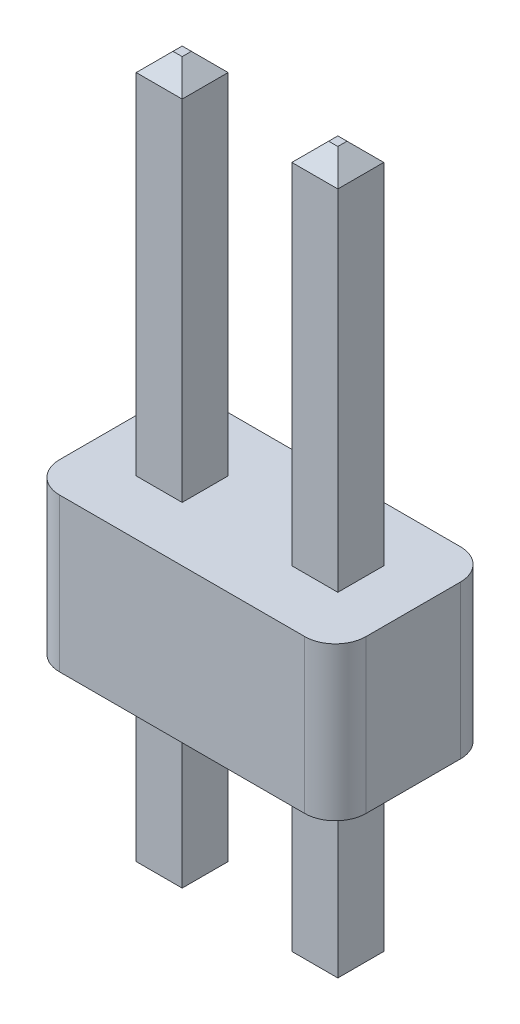
ISO-10303-21;
HEADER;
FILE_DESCRIPTION(('STEP AP214'),'2;1');
FILE_NAME('part.step','',(''),(''),'','','');
FILE_SCHEMA(('AUTOMOTIVE_DESIGN { 1 0 10303 214 1 1 1 1 }'));
ENDSEC;
DATA;
#1=APPLICATION_CONTEXT('core data for automotive mechanical design processes');
#2=APPLICATION_PROTOCOL_DEFINITION('international standard','automotive_design',2000,#1);
#3=PRODUCT_CONTEXT('',#1,'mechanical');
#4=PRODUCT('Part','Part','',(#3));
#5=PRODUCT_RELATED_PRODUCT_CATEGORY('part','',(#4));
#6=PRODUCT_DEFINITION_FORMATION('','',#4);
#7=PRODUCT_DEFINITION_CONTEXT('part definition',#1,'design');
#8=PRODUCT_DEFINITION('design','',#6,#7);
#9=PRODUCT_DEFINITION_SHAPE('','',#8);
#10=(LENGTH_UNIT() NAMED_UNIT(*) SI_UNIT(.MILLI.,.METRE.));
#11=(NAMED_UNIT(*) PLANE_ANGLE_UNIT() SI_UNIT($,.RADIAN.));
#12=(NAMED_UNIT(*) SI_UNIT($,.STERADIAN.) SOLID_ANGLE_UNIT());
#13=UNCERTAINTY_MEASURE_WITH_UNIT(LENGTH_MEASURE(1.E-05),#10,'distance_accuracy_value','');
#14=(GEOMETRIC_REPRESENTATION_CONTEXT(3) GLOBAL_UNCERTAINTY_ASSIGNED_CONTEXT((#13)) GLOBAL_UNIT_ASSIGNED_CONTEXT((#10,
#11,#12)) REPRESENTATION_CONTEXT('',''));
#15=CARTESIAN_POINT('',(0.,0.,0.));
#16=DIRECTION('',(0.,0.,1.));
#17=DIRECTION('',(1.,0.,0.));
#18=AXIS2_PLACEMENT_3D('',#15,#16,#17);
#19=CARTESIAN_POINT('',(2.,2.5,0.77));
#20=DIRECTION('',(0.,-1.,0.));
#21=DIRECTION('',(0.,0.,-1.));
#22=AXIS2_PLACEMENT_3D('',#19,#20,#21);
#23=CYLINDRICAL_SURFACE('',#22,0.5);
#24=CARTESIAN_POINT('',(2.,0.,0.77));
#25=DIRECTION('',(0.,1.,0.));
#26=DIRECTION('',(0.,0.,1.));
#27=AXIS2_PLACEMENT_3D('',#24,#25,#26);
#28=CIRCLE('',#27,0.5);
#29=CARTESIAN_POINT('',(2.,0.,1.27));
#30=VERTEX_POINT('',#29);
#31=CARTESIAN_POINT('',(2.5,0.,0.77));
#32=VERTEX_POINT('',#31);
#33=EDGE_CURVE('E300',#30,#32,#28,.T.);
#34=ORIENTED_EDGE('',*,*,#33,.T.);
#35=DIRECTION('',(0.,-1.,0.));
#36=VECTOR('',#35,1.);
#37=CARTESIAN_POINT('',(2.5,2.5,0.77));
#38=LINE('',#37,#36);
#39=CARTESIAN_POINT('',(2.5,2.5,0.77));
#40=VERTEX_POINT('',#39);
#41=EDGE_CURVE('E355',#40,#32,#38,.T.);
#42=ORIENTED_EDGE('',*,*,#41,.F.);
#43=CARTESIAN_POINT('',(2.,2.5,0.77));
#44=DIRECTION('',(0.,1.,0.));
#45=DIRECTION('',(0.,0.,1.));
#46=AXIS2_PLACEMENT_3D('',#43,#44,#45);
#47=CIRCLE('',#46,0.5);
#48=CARTESIAN_POINT('',(2.,2.5,1.27));
#49=VERTEX_POINT('',#48);
#50=EDGE_CURVE('E301',#49,#40,#47,.T.);
#51=ORIENTED_EDGE('',*,*,#50,.F.);
#52=DIRECTION('',(0.,-1.,0.));
#53=VECTOR('',#52,1.);
#54=CARTESIAN_POINT('',(2.,2.5,1.27));
#55=LINE('',#54,#53);
#56=EDGE_CURVE('E319',#49,#30,#55,.T.);
#57=ORIENTED_EDGE('',*,*,#56,.T.);
#58=EDGE_LOOP('',(#34,#42,#51,#57));
#59=FACE_BOUND('',#58,.T.);
#60=ADVANCED_FACE('F34',(#59),#23,.T.);
#61=CARTESIAN_POINT('',(2.5,2.5,-0.77));
#62=DIRECTION('',(-1.,0.,0.));
#63=DIRECTION('',(0.,0.,1.));
#64=AXIS2_PLACEMENT_3D('',#61,#62,#63);
#65=PLANE('',#64);
#66=DIRECTION('',(0.,0.,-1.));
#67=VECTOR('',#66,1.);
#68=CARTESIAN_POINT('',(2.5,0.,-0.77));
#69=LINE('',#68,#67);
#70=CARTESIAN_POINT('',(2.5,0.,-0.77));
#71=VERTEX_POINT('',#70);
#72=EDGE_CURVE('E322',#32,#71,#69,.T.);
#73=ORIENTED_EDGE('',*,*,#72,.T.);
#74=DIRECTION('',(0.,-1.,0.));
#75=VECTOR('',#74,1.);
#76=CARTESIAN_POINT('',(2.5,2.5,-0.77));
#77=LINE('',#76,#75);
#78=CARTESIAN_POINT('',(2.5,2.5,-0.77));
#79=VERTEX_POINT('',#78);
#80=EDGE_CURVE('E352',#79,#71,#77,.T.);
#81=ORIENTED_EDGE('',*,*,#80,.F.);
#82=DIRECTION('',(0.,0.,-1.));
#83=VECTOR('',#82,1.);
#84=CARTESIAN_POINT('',(2.5,2.5,-0.77));
#85=LINE('',#84,#83);
#86=EDGE_CURVE('E304',#40,#79,#85,.T.);
#87=ORIENTED_EDGE('',*,*,#86,.F.);
#88=ORIENTED_EDGE('',*,*,#41,.T.);
#89=EDGE_LOOP('',(#73,#81,#87,#88));
#90=FACE_BOUND('',#89,.T.);
#91=ADVANCED_FACE('F521',(#90),#65,.F.);
#92=CARTESIAN_POINT('',(2.,2.5,-0.77));
#93=DIRECTION('',(0.,-1.,0.));
#94=DIRECTION('',(0.,0.,-1.));
#95=AXIS2_PLACEMENT_3D('',#92,#93,#94);
#96=CYLINDRICAL_SURFACE('',#95,0.5);
#97=CARTESIAN_POINT('',(2.,0.,-0.77));
#98=DIRECTION('',(0.,1.,0.));
#99=DIRECTION('',(0.,0.,1.));
#100=AXIS2_PLACEMENT_3D('',#97,#98,#99);
#101=CIRCLE('',#100,0.5);
#102=CARTESIAN_POINT('',(2.,0.,-1.27));
#103=VERTEX_POINT('',#102);
#104=EDGE_CURVE('E324',#71,#103,#101,.T.);
#105=ORIENTED_EDGE('',*,*,#104,.T.);
#106=DIRECTION('',(0.,-1.,0.));
#107=VECTOR('',#106,1.);
#108=CARTESIAN_POINT('',(2.,2.5,-1.27));
#109=LINE('',#108,#107);
#110=CARTESIAN_POINT('',(2.,2.5,-1.27));
#111=VERTEX_POINT('',#110);
#112=EDGE_CURVE('E349',#111,#103,#109,.T.);
#113=ORIENTED_EDGE('',*,*,#112,.F.);
#114=CARTESIAN_POINT('',(2.,2.5,-0.77));
#115=DIRECTION('',(0.,1.,0.));
#116=DIRECTION('',(0.,0.,1.));
#117=AXIS2_PLACEMENT_3D('',#114,#115,#116);
#118=CIRCLE('',#117,0.5);
#119=EDGE_CURVE('E307',#79,#111,#118,.T.);
#120=ORIENTED_EDGE('',*,*,#119,.F.);
#121=ORIENTED_EDGE('',*,*,#80,.T.);
#122=EDGE_LOOP('',(#105,#113,#120,#121));
#123=FACE_BOUND('',#122,.T.);
#124=ADVANCED_FACE('F527',(#123),#96,.T.);
#125=CARTESIAN_POINT('',(-2.,2.5,-1.27));
#126=DIRECTION('',(0.,0.,1.));
#127=DIRECTION('',(1.,0.,0.));
#128=AXIS2_PLACEMENT_3D('',#125,#126,#127);
#129=PLANE('',#128);
#130=DIRECTION('',(-1.,0.,0.));
#131=VECTOR('',#130,1.);
#132=CARTESIAN_POINT('',(-2.,0.,-1.27));
#133=LINE('',#132,#131);
#134=CARTESIAN_POINT('',(-2.,0.,-1.27));
#135=VERTEX_POINT('',#134);
#136=EDGE_CURVE('E326',#103,#135,#133,.T.);
#137=ORIENTED_EDGE('',*,*,#136,.T.);
#138=DIRECTION('',(0.,-1.,0.));
#139=VECTOR('',#138,1.);
#140=CARTESIAN_POINT('',(-2.,2.5,-1.27));
#141=LINE('',#140,#139);
#142=CARTESIAN_POINT('',(-2.,2.5,-1.27));
#143=VERTEX_POINT('',#142);
#144=EDGE_CURVE('E346',#143,#135,#141,.T.);
#145=ORIENTED_EDGE('',*,*,#144,.F.);
#146=DIRECTION('',(-1.,0.,0.));
#147=VECTOR('',#146,1.);
#148=CARTESIAN_POINT('',(-2.,2.5,-1.27));
#149=LINE('',#148,#147);
#150=EDGE_CURVE('E309',#111,#143,#149,.T.);
#151=ORIENTED_EDGE('',*,*,#150,.F.);
#152=ORIENTED_EDGE('',*,*,#112,.T.);
#153=EDGE_LOOP('',(#137,#145,#151,#152));
#154=FACE_BOUND('',#153,.T.);
#155=ADVANCED_FACE('F871',(#154),#129,.F.);
#156=CARTESIAN_POINT('',(-2.,2.5,-0.77));
#157=DIRECTION('',(0.,-1.,0.));
#158=DIRECTION('',(0.,0.,-1.));
#159=AXIS2_PLACEMENT_3D('',#156,#157,#158);
#160=CYLINDRICAL_SURFACE('',#159,0.5);
#161=CARTESIAN_POINT('',(-2.,0.,-0.77));
#162=DIRECTION('',(0.,1.,0.));
#163=DIRECTION('',(0.,0.,1.));
#164=AXIS2_PLACEMENT_3D('',#161,#162,#163);
#165=CIRCLE('',#164,0.5);
#166=CARTESIAN_POINT('',(-2.5,0.,-0.77));
#167=VERTEX_POINT('',#166);
#168=EDGE_CURVE('E328',#135,#167,#165,.T.);
#169=ORIENTED_EDGE('',*,*,#168,.T.);
#170=DIRECTION('',(0.,-1.,0.));
#171=VECTOR('',#170,1.);
#172=CARTESIAN_POINT('',(-2.5,2.5,-0.77));
#173=LINE('',#172,#171);
#174=CARTESIAN_POINT('',(-2.5,2.5,-0.77));
#175=VERTEX_POINT('',#174);
#176=EDGE_CURVE('E343',#175,#167,#173,.T.);
#177=ORIENTED_EDGE('',*,*,#176,.F.);
#178=CARTESIAN_POINT('',(-2.,2.5,-0.77));
#179=DIRECTION('',(0.,1.,0.));
#180=DIRECTION('',(0.,0.,1.));
#181=AXIS2_PLACEMENT_3D('',#178,#179,#180);
#182=CIRCLE('',#181,0.5);
#183=EDGE_CURVE('E311',#143,#175,#182,.T.);
#184=ORIENTED_EDGE('',*,*,#183,.F.);
#185=ORIENTED_EDGE('',*,*,#144,.T.);
#186=EDGE_LOOP('',(#169,#177,#184,#185));
#187=FACE_BOUND('',#186,.T.);
#188=ADVANCED_FACE('F860',(#187),#160,.T.);
#189=CARTESIAN_POINT('',(-2.5,2.5,0.77));
#190=DIRECTION('',(1.,0.,0.));
#191=DIRECTION('',(0.,0.,-1.));
#192=AXIS2_PLACEMENT_3D('',#189,#190,#191);
#193=PLANE('',#192);
#194=DIRECTION('',(0.,0.,1.));
#195=VECTOR('',#194,1.);
#196=CARTESIAN_POINT('',(-2.5,0.,0.77));
#197=LINE('',#196,#195);
#198=CARTESIAN_POINT('',(-2.5,0.,0.77));
#199=VERTEX_POINT('',#198);
#200=EDGE_CURVE('E330',#167,#199,#197,.T.);
#201=ORIENTED_EDGE('',*,*,#200,.T.);
#202=DIRECTION('',(0.,-1.,0.));
#203=VECTOR('',#202,1.);
#204=CARTESIAN_POINT('',(-2.5,2.5,0.77));
#205=LINE('',#204,#203);
#206=CARTESIAN_POINT('',(-2.5,2.5,0.77));
#207=VERTEX_POINT('',#206);
#208=EDGE_CURVE('E340',#207,#199,#205,.T.);
#209=ORIENTED_EDGE('',*,*,#208,.F.);
#210=DIRECTION('',(0.,0.,1.));
#211=VECTOR('',#210,1.);
#212=CARTESIAN_POINT('',(-2.5,2.5,0.77));
#213=LINE('',#212,#211);
#214=EDGE_CURVE('E313',#175,#207,#213,.T.);
#215=ORIENTED_EDGE('',*,*,#214,.F.);
#216=ORIENTED_EDGE('',*,*,#176,.T.);
#217=EDGE_LOOP('',(#201,#209,#215,#216));
#218=FACE_BOUND('',#217,.T.);
#219=ADVANCED_FACE('F849',(#218),#193,.F.);
#220=CARTESIAN_POINT('',(-2.,2.5,0.77));
#221=DIRECTION('',(0.,-1.,0.));
#222=DIRECTION('',(0.,0.,-1.));
#223=AXIS2_PLACEMENT_3D('',#220,#221,#222);
#224=CYLINDRICAL_SURFACE('',#223,0.5);
#225=CARTESIAN_POINT('',(-2.,0.,0.77));
#226=DIRECTION('',(0.,1.,0.));
#227=DIRECTION('',(0.,0.,1.));
#228=AXIS2_PLACEMENT_3D('',#225,#226,#227);
#229=CIRCLE('',#228,0.5);
#230=CARTESIAN_POINT('',(-2.,0.,1.27));
#231=VERTEX_POINT('',#230);
#232=EDGE_CURVE('E332',#199,#231,#229,.T.);
#233=ORIENTED_EDGE('',*,*,#232,.T.);
#234=DIRECTION('',(0.,-1.,0.));
#235=VECTOR('',#234,1.);
#236=CARTESIAN_POINT('',(-2.,2.5,1.27));
#237=LINE('',#236,#235);
#238=CARTESIAN_POINT('',(-2.,2.5,1.27));
#239=VERTEX_POINT('',#238);
#240=EDGE_CURVE('E337',#239,#231,#237,.T.);
#241=ORIENTED_EDGE('',*,*,#240,.F.);
#242=CARTESIAN_POINT('',(-2.,2.5,0.77));
#243=DIRECTION('',(0.,1.,0.));
#244=DIRECTION('',(0.,0.,1.));
#245=AXIS2_PLACEMENT_3D('',#242,#243,#244);
#246=CIRCLE('',#245,0.5);
#247=EDGE_CURVE('E315',#207,#239,#246,.T.);
#248=ORIENTED_EDGE('',*,*,#247,.F.);
#249=ORIENTED_EDGE('',*,*,#208,.T.);
#250=EDGE_LOOP('',(#233,#241,#248,#249));
#251=FACE_BOUND('',#250,.T.);
#252=ADVANCED_FACE('F838',(#251),#224,.T.);
#253=CARTESIAN_POINT('',(2.,2.5,1.27));
#254=DIRECTION('',(0.,0.,-1.));
#255=DIRECTION('',(-1.,0.,0.));
#256=AXIS2_PLACEMENT_3D('',#253,#254,#255);
#257=PLANE('',#256);
#258=DIRECTION('',(1.,0.,0.));
#259=VECTOR('',#258,1.);
#260=CARTESIAN_POINT('',(2.,0.,1.27));
#261=LINE('',#260,#259);
#262=EDGE_CURVE('E305',#231,#30,#261,.T.);
#263=ORIENTED_EDGE('',*,*,#262,.T.);
#264=ORIENTED_EDGE('',*,*,#56,.F.);
#265=DIRECTION('',(1.,0.,0.));
#266=VECTOR('',#265,1.);
#267=CARTESIAN_POINT('',(2.,2.5,1.27));
#268=LINE('',#267,#266);
#269=EDGE_CURVE('E317',#239,#49,#268,.T.);
#270=ORIENTED_EDGE('',*,*,#269,.F.);
#271=ORIENTED_EDGE('',*,*,#240,.T.);
#272=EDGE_LOOP('',(#263,#264,#270,#271));
#273=FACE_BOUND('',#272,.T.);
#274=ADVANCED_FACE('F828',(#273),#257,.F.);
#275=CARTESIAN_POINT('',(2.,2.5,0.77));
#276=DIRECTION('',(0.,1.,0.));
#277=DIRECTION('',(0.,0.,1.));
#278=AXIS2_PLACEMENT_3D('',#275,#276,#277);
#279=PLANE('',#278);
#280=DIRECTION('',(0.,0.,1.));
#281=VECTOR('',#280,1.);
#282=CARTESIAN_POINT('',(0.895,2.5,0.77));
#283=LINE('',#282,#281);
#284=CARTESIAN_POINT('',(0.895,2.5,-0.375));
#285=VERTEX_POINT('',#284);
#286=CARTESIAN_POINT('',(0.895,2.5,0.375));
#287=VERTEX_POINT('',#286);
#288=EDGE_CURVE('E274',#285,#287,#283,.T.);
#289=ORIENTED_EDGE('',*,*,#288,.F.);
#290=DIRECTION('',(-1.,0.,0.));
#291=VECTOR('',#290,1.);
#292=CARTESIAN_POINT('',(2.,2.5,-0.375));
#293=LINE('',#292,#291);
#294=CARTESIAN_POINT('',(1.645,2.5,-0.375));
#295=VERTEX_POINT('',#294);
#296=EDGE_CURVE('E252',#295,#285,#293,.T.);
#297=ORIENTED_EDGE('',*,*,#296,.F.);
#298=DIRECTION('',(0.,0.,-1.));
#299=VECTOR('',#298,1.);
#300=CARTESIAN_POINT('',(1.645,2.5,0.77));
#301=LINE('',#300,#299);
#302=CARTESIAN_POINT('',(1.645,2.5,0.375));
#303=VERTEX_POINT('',#302);
#304=EDGE_CURVE('E245',#303,#295,#301,.T.);
#305=ORIENTED_EDGE('',*,*,#304,.F.);
#306=DIRECTION('',(1.,0.,0.));
#307=VECTOR('',#306,1.);
#308=CARTESIAN_POINT('',(2.,2.5,0.375));
#309=LINE('',#308,#307);
#310=EDGE_CURVE('E249',#287,#303,#309,.T.);
#311=ORIENTED_EDGE('',*,*,#310,.F.);
#312=EDGE_LOOP('',(#289,#297,#305,#311));
#313=FACE_BOUND('',#312,.T.);
#314=DIRECTION('',(0.,0.,-1.));
#315=VECTOR('',#314,1.);
#316=CARTESIAN_POINT('',(-0.895,2.5,0.77));
#317=LINE('',#316,#315);
#318=CARTESIAN_POINT('',(-0.895,2.5,0.375));
#319=VERTEX_POINT('',#318);
#320=CARTESIAN_POINT('',(-0.895,2.5,-0.375));
#321=VERTEX_POINT('',#320);
#322=EDGE_CURVE('E297',#319,#321,#317,.T.);
#323=ORIENTED_EDGE('',*,*,#322,.F.);
#324=DIRECTION('',(1.,0.,0.));
#325=VECTOR('',#324,1.);
#326=CARTESIAN_POINT('',(2.,2.5,0.375));
#327=LINE('',#326,#325);
#328=CARTESIAN_POINT('',(-1.645,2.5,0.375));
#329=VERTEX_POINT('',#328);
#330=EDGE_CURVE('E294',#329,#319,#327,.T.);
#331=ORIENTED_EDGE('',*,*,#330,.F.);
#332=DIRECTION('',(0.,0.,1.));
#333=VECTOR('',#332,1.);
#334=CARTESIAN_POINT('',(-1.645,2.5,0.77));
#335=LINE('',#334,#333);
#336=CARTESIAN_POINT('',(-1.645,2.5,-0.375));
#337=VERTEX_POINT('',#336);
#338=EDGE_CURVE('E291',#337,#329,#335,.T.);
#339=ORIENTED_EDGE('',*,*,#338,.F.);
#340=DIRECTION('',(-1.,0.,0.));
#341=VECTOR('',#340,1.);
#342=CARTESIAN_POINT('',(2.,2.5,-0.375));
#343=LINE('',#342,#341);
#344=EDGE_CURVE('E279',#321,#337,#343,.T.);
#345=ORIENTED_EDGE('',*,*,#344,.F.);
#346=EDGE_LOOP('',(#323,#331,#339,#345));
#347=FACE_BOUND('',#346,.T.);
#348=ORIENTED_EDGE('',*,*,#50,.T.);
#349=ORIENTED_EDGE('',*,*,#86,.T.);
#350=ORIENTED_EDGE('',*,*,#119,.T.);
#351=ORIENTED_EDGE('',*,*,#150,.T.);
#352=ORIENTED_EDGE('',*,*,#183,.T.);
#353=ORIENTED_EDGE('',*,*,#214,.T.);
#354=ORIENTED_EDGE('',*,*,#247,.T.);
#355=ORIENTED_EDGE('',*,*,#269,.T.);
#356=EDGE_LOOP('',(#348,#349,#350,#351,#352,#353,#354,#355));
#357=FACE_BOUND('',#356,.T.);
#358=ADVANCED_FACE('F247',(#313,#347,#357),#279,.T.);
#359=CARTESIAN_POINT('',(2.,0.,0.77));
#360=DIRECTION('',(0.,1.,0.));
#361=DIRECTION('',(0.,0.,1.));
#362=AXIS2_PLACEMENT_3D('',#359,#360,#361);
#363=PLANE('',#362);
#364=DIRECTION('',(-1.,0.,0.));
#365=VECTOR('',#364,1.);
#366=CARTESIAN_POINT('',(2.,0.,-0.375));
#367=LINE('',#366,#365);
#368=CARTESIAN_POINT('',(1.645,0.,-0.375));
#369=VERTEX_POINT('',#368);
#370=CARTESIAN_POINT('',(0.895,0.,-0.375));
#371=VERTEX_POINT('',#370);
#372=EDGE_CURVE('E376',#369,#371,#367,.T.);
#373=ORIENTED_EDGE('',*,*,#372,.T.);
#374=DIRECTION('',(0.,0.,1.));
#375=VECTOR('',#374,1.);
#376=CARTESIAN_POINT('',(0.895,0.,0.77));
#377=LINE('',#376,#375);
#378=CARTESIAN_POINT('',(0.895,0.,0.375));
#379=VERTEX_POINT('',#378);
#380=EDGE_CURVE('E379',#371,#379,#377,.T.);
#381=ORIENTED_EDGE('',*,*,#380,.T.);
#382=DIRECTION('',(1.,0.,0.));
#383=VECTOR('',#382,1.);
#384=CARTESIAN_POINT('',(2.,0.,0.375));
#385=LINE('',#384,#383);
#386=CARTESIAN_POINT('',(1.645,0.,0.375));
#387=VERTEX_POINT('',#386);
#388=EDGE_CURVE('E370',#379,#387,#385,.T.);
#389=ORIENTED_EDGE('',*,*,#388,.T.);
#390=DIRECTION('',(0.,0.,-1.));
#391=VECTOR('',#390,1.);
#392=CARTESIAN_POINT('',(1.645,0.,0.77));
#393=LINE('',#392,#391);
#394=EDGE_CURVE('E373',#387,#369,#393,.T.);
#395=ORIENTED_EDGE('',*,*,#394,.T.);
#396=EDGE_LOOP('',(#373,#381,#389,#395));
#397=FACE_BOUND('',#396,.T.);
#398=DIRECTION('',(1.,0.,0.));
#399=VECTOR('',#398,1.);
#400=CARTESIAN_POINT('',(2.,0.,0.375));
#401=LINE('',#400,#399);
#402=CARTESIAN_POINT('',(-1.645,0.,0.375));
#403=VERTEX_POINT('',#402);
#404=CARTESIAN_POINT('',(-0.895,0.,0.375));
#405=VERTEX_POINT('',#404);
#406=EDGE_CURVE('E364',#403,#405,#401,.T.);
#407=ORIENTED_EDGE('',*,*,#406,.T.);
#408=DIRECTION('',(0.,0.,-1.));
#409=VECTOR('',#408,1.);
#410=CARTESIAN_POINT('',(-0.895,0.,0.77));
#411=LINE('',#410,#409);
#412=CARTESIAN_POINT('',(-0.895,0.,-0.375));
#413=VERTEX_POINT('',#412);
#414=EDGE_CURVE('E367',#405,#413,#411,.T.);
#415=ORIENTED_EDGE('',*,*,#414,.T.);
#416=DIRECTION('',(-1.,0.,0.));
#417=VECTOR('',#416,1.);
#418=CARTESIAN_POINT('',(2.,0.,-0.375));
#419=LINE('',#418,#417);
#420=CARTESIAN_POINT('',(-1.645,0.,-0.375));
#421=VERTEX_POINT('',#420);
#422=EDGE_CURVE('E358',#413,#421,#419,.T.);
#423=ORIENTED_EDGE('',*,*,#422,.T.);
#424=DIRECTION('',(0.,0.,1.));
#425=VECTOR('',#424,1.);
#426=CARTESIAN_POINT('',(-1.645,0.,0.77));
#427=LINE('',#426,#425);
#428=EDGE_CURVE('E361',#421,#403,#427,.T.);
#429=ORIENTED_EDGE('',*,*,#428,.T.);
#430=EDGE_LOOP('',(#407,#415,#423,#429));
#431=FACE_BOUND('',#430,.T.);
#432=ORIENTED_EDGE('',*,*,#33,.F.);
#433=ORIENTED_EDGE('',*,*,#262,.F.);
#434=ORIENTED_EDGE('',*,*,#232,.F.);
#435=ORIENTED_EDGE('',*,*,#200,.F.);
#436=ORIENTED_EDGE('',*,*,#168,.F.);
#437=ORIENTED_EDGE('',*,*,#136,.F.);
#438=ORIENTED_EDGE('',*,*,#104,.F.);
#439=ORIENTED_EDGE('',*,*,#72,.F.);
#440=EDGE_LOOP('',(#432,#433,#434,#435,#436,#437,#438,#439));
#441=FACE_BOUND('',#440,.T.);
#442=ADVANCED_FACE('F807',(#397,#431,#441),#363,.F.);
#443=CARTESIAN_POINT('',(0.,-3.25,0.));
#444=DIRECTION('',(0.,-1.,0.));
#445=DIRECTION('',(0.,0.,-1.));
#446=AXIS2_PLACEMENT_3D('',#443,#444,#445);
#447=PLANE('',#446);
#448=DIRECTION('',(0.,0.,1.));
#449=VECTOR('',#448,1.);
#450=CARTESIAN_POINT('',(-1.195,-3.25,0.));
#451=LINE('',#450,#449);
#452=CARTESIAN_POINT('',(-1.195,-3.25,-0.0750000000000004));
#453=VERTEX_POINT('',#452);
#454=CARTESIAN_POINT('',(-1.195,-3.25,0.075));
#455=VERTEX_POINT('',#454);
#456=EDGE_CURVE('E405',#453,#455,#451,.T.);
#457=ORIENTED_EDGE('',*,*,#456,.T.);
#458=DIRECTION('',(-1.,0.,0.));
#459=VECTOR('',#458,1.);
#460=CARTESIAN_POINT('',(0.,-3.25,0.075));
#461=LINE('',#460,#459);
#462=CARTESIAN_POINT('',(-1.345,-3.25,0.075));
#463=VERTEX_POINT('',#462);
#464=EDGE_CURVE('E409',#455,#463,#461,.T.);
#465=ORIENTED_EDGE('',*,*,#464,.T.);
#466=DIRECTION('',(0.,0.,-1.));
#467=VECTOR('',#466,1.);
#468=CARTESIAN_POINT('',(-1.345,-3.25,0.));
#469=LINE('',#468,#467);
#470=CARTESIAN_POINT('',(-1.345,-3.25,-0.0750000000000004));
#471=VERTEX_POINT('',#470);
#472=EDGE_CURVE('E407',#463,#471,#469,.T.);
#473=ORIENTED_EDGE('',*,*,#472,.T.);
#474=DIRECTION('',(1.,0.,0.));
#475=VECTOR('',#474,1.);
#476=CARTESIAN_POINT('',(0.,-3.25,-0.0750000000000004));
#477=LINE('',#476,#475);
#478=EDGE_CURVE('E403',#471,#453,#477,.T.);
#479=ORIENTED_EDGE('',*,*,#478,.T.);
#480=EDGE_LOOP('',(#457,#465,#473,#479));
#481=FACE_BOUND('',#480,.T.);
#482=ADVANCED_FACE('F798',(#481),#447,.T.);
#483=CARTESIAN_POINT('',(-1.645,-3.25,-0.375));
#484=DIRECTION('',(0.,0.,-1.));
#485=DIRECTION('',(-1.,0.,0.));
#486=AXIS2_PLACEMENT_3D('',#483,#484,#485);
#487=PLANE('',#486);
#488=DIRECTION('',(0.,1.,0.));
#489=VECTOR('',#488,1.);
#490=CARTESIAN_POINT('',(-0.895,-3.25,-0.375));
#491=LINE('',#490,#489);
#492=CARTESIAN_POINT('',(-0.895,-2.95,-0.375));
#493=VERTEX_POINT('',#492);
#494=EDGE_CURVE('E287',#493,#413,#491,.T.);
#495=ORIENTED_EDGE('',*,*,#494,.F.);
#496=DIRECTION('',(-1.,0.,0.));
#497=VECTOR('',#496,1.);
#498=CARTESIAN_POINT('',(-1.645,-2.95,-0.375));
#499=LINE('',#498,#497);
#500=CARTESIAN_POINT('',(-1.645,-2.95,-0.375));
#501=VERTEX_POINT('',#500);
#502=EDGE_CURVE('E416',#493,#501,#499,.T.);
#503=ORIENTED_EDGE('',*,*,#502,.T.);
#504=DIRECTION('',(0.,1.,0.));
#505=VECTOR('',#504,1.);
#506=CARTESIAN_POINT('',(-1.645,-3.25,-0.375));
#507=LINE('',#506,#505);
#508=EDGE_CURVE('E284',#501,#421,#507,.T.);
#509=ORIENTED_EDGE('',*,*,#508,.T.);
#510=ORIENTED_EDGE('',*,*,#422,.F.);
#511=EDGE_LOOP('',(#495,#503,#509,#510));
#512=FACE_BOUND('',#511,.T.);
#513=ADVANCED_FACE('F734',(#512),#487,.T.);
#514=CARTESIAN_POINT('',(-1.645,-3.25,0.375));
#515=DIRECTION('',(-1.,0.,0.));
#516=DIRECTION('',(0.,0.,1.));
#517=AXIS2_PLACEMENT_3D('',#514,#515,#516);
#518=PLANE('',#517);
#519=ORIENTED_EDGE('',*,*,#508,.F.);
#520=DIRECTION('',(0.,0.,1.));
#521=VECTOR('',#520,1.);
#522=CARTESIAN_POINT('',(-1.645,-2.95,0.375));
#523=LINE('',#522,#521);
#524=CARTESIAN_POINT('',(-1.645,-2.95,0.375));
#525=VERTEX_POINT('',#524);
#526=EDGE_CURVE('E412',#501,#525,#523,.T.);
#527=ORIENTED_EDGE('',*,*,#526,.T.);
#528=DIRECTION('',(0.,1.,0.));
#529=VECTOR('',#528,1.);
#530=CARTESIAN_POINT('',(-1.645,-3.25,0.375));
#531=LINE('',#530,#529);
#532=EDGE_CURVE('E281',#525,#403,#531,.T.);
#533=ORIENTED_EDGE('',*,*,#532,.T.);
#534=ORIENTED_EDGE('',*,*,#428,.F.);
#535=EDGE_LOOP('',(#519,#527,#533,#534));
#536=FACE_BOUND('',#535,.T.);
#537=ADVANCED_FACE('F745',(#536),#518,.T.);
#538=CARTESIAN_POINT('',(-0.895,-3.25,0.375));
#539=DIRECTION('',(0.,0.,1.));
#540=DIRECTION('',(1.,0.,0.));
#541=AXIS2_PLACEMENT_3D('',#538,#539,#540);
#542=PLANE('',#541);
#543=ORIENTED_EDGE('',*,*,#532,.F.);
#544=DIRECTION('',(1.,0.,0.));
#545=VECTOR('',#544,1.);
#546=CARTESIAN_POINT('',(-0.895,-2.95,0.375));
#547=LINE('',#546,#545);
#548=CARTESIAN_POINT('',(-0.895,-2.95,0.375));
#549=VERTEX_POINT('',#548);
#550=EDGE_CURVE('E400',#525,#549,#547,.T.);
#551=ORIENTED_EDGE('',*,*,#550,.T.);
#552=DIRECTION('',(0.,1.,0.));
#553=VECTOR('',#552,1.);
#554=CARTESIAN_POINT('',(-0.895,-3.25,0.375));
#555=LINE('',#554,#553);
#556=EDGE_CURVE('E277',#549,#405,#555,.T.);
#557=ORIENTED_EDGE('',*,*,#556,.T.);
#558=ORIENTED_EDGE('',*,*,#406,.F.);
#559=EDGE_LOOP('',(#543,#551,#557,#558));
#560=FACE_BOUND('',#559,.T.);
#561=ADVANCED_FACE('F756',(#560),#542,.T.);
#562=CARTESIAN_POINT('',(-0.895,-3.25,-0.375));
#563=DIRECTION('',(1.,0.,0.));
#564=DIRECTION('',(0.,0.,-1.));
#565=AXIS2_PLACEMENT_3D('',#562,#563,#564);
#566=PLANE('',#565);
#567=ORIENTED_EDGE('',*,*,#556,.F.);
#568=DIRECTION('',(0.,0.,-1.));
#569=VECTOR('',#568,1.);
#570=CARTESIAN_POINT('',(-0.895,-2.95,-0.375));
#571=LINE('',#570,#569);
#572=EDGE_CURVE('E414',#549,#493,#571,.T.);
#573=ORIENTED_EDGE('',*,*,#572,.T.);
#574=ORIENTED_EDGE('',*,*,#494,.T.);
#575=ORIENTED_EDGE('',*,*,#414,.F.);
#576=EDGE_LOOP('',(#567,#573,#574,#575));
#577=FACE_BOUND('',#576,.T.);
#578=ADVANCED_FACE('F764',(#577),#566,.T.);
#579=CARTESIAN_POINT('',(-0.895,8.2,-0.375));
#580=VERTEX_POINT('',#579);
#581=EDGE_CURVE('E276',#321,#580,#491,.T.);
#582=ORIENTED_EDGE('',*,*,#581,.T.);
#583=DIRECTION('',(0.,0.,1.));
#584=VECTOR('',#583,1.);
#585=CARTESIAN_POINT('',(-0.895,8.2,0.375));
#586=LINE('',#585,#584);
#587=CARTESIAN_POINT('',(-0.895,8.2,0.375));
#588=VERTEX_POINT('',#587);
#589=EDGE_CURVE('E432',#580,#588,#586,.T.);
#590=ORIENTED_EDGE('',*,*,#589,.T.);
#591=EDGE_CURVE('E280',#319,#588,#555,.T.);
#592=ORIENTED_EDGE('',*,*,#591,.F.);
#593=ORIENTED_EDGE('',*,*,#322,.T.);
#594=EDGE_LOOP('',(#582,#590,#592,#593));
#595=FACE_BOUND('',#594,.T.);
#596=ADVANCED_FACE('F753',(#595),#566,.T.);
#597=ORIENTED_EDGE('',*,*,#591,.T.);
#598=DIRECTION('',(-1.,0.,0.));
#599=VECTOR('',#598,1.);
#600=CARTESIAN_POINT('',(-1.645,8.2,0.375));
#601=LINE('',#600,#599);
#602=CARTESIAN_POINT('',(-1.645,8.2,0.375));
#603=VERTEX_POINT('',#602);
#604=EDGE_CURVE('E434',#588,#603,#601,.T.);
#605=ORIENTED_EDGE('',*,*,#604,.T.);
#606=EDGE_CURVE('E283',#329,#603,#531,.T.);
#607=ORIENTED_EDGE('',*,*,#606,.F.);
#608=ORIENTED_EDGE('',*,*,#330,.T.);
#609=EDGE_LOOP('',(#597,#605,#607,#608));
#610=FACE_BOUND('',#609,.T.);
#611=ADVANCED_FACE('F742',(#610),#542,.T.);
#612=ORIENTED_EDGE('',*,*,#606,.T.);
#613=DIRECTION('',(0.,0.,-1.));
#614=VECTOR('',#613,1.);
#615=CARTESIAN_POINT('',(-1.645,8.2,-0.375));
#616=LINE('',#615,#614);
#617=CARTESIAN_POINT('',(-1.645,8.2,-0.375));
#618=VERTEX_POINT('',#617);
#619=EDGE_CURVE('E427',#603,#618,#616,.T.);
#620=ORIENTED_EDGE('',*,*,#619,.T.);
#621=EDGE_CURVE('E286',#337,#618,#507,.T.);
#622=ORIENTED_EDGE('',*,*,#621,.F.);
#623=ORIENTED_EDGE('',*,*,#338,.T.);
#624=EDGE_LOOP('',(#612,#620,#622,#623));
#625=FACE_BOUND('',#624,.T.);
#626=ADVANCED_FACE('F731',(#625),#518,.T.);
#627=ORIENTED_EDGE('',*,*,#621,.T.);
#628=DIRECTION('',(1.,0.,0.));
#629=VECTOR('',#628,1.);
#630=CARTESIAN_POINT('',(-0.895,8.2,-0.375));
#631=LINE('',#630,#629);
#632=EDGE_CURVE('E430',#618,#580,#631,.T.);
#633=ORIENTED_EDGE('',*,*,#632,.T.);
#634=ORIENTED_EDGE('',*,*,#581,.F.);
#635=ORIENTED_EDGE('',*,*,#344,.T.);
#636=EDGE_LOOP('',(#627,#633,#634,#635));
#637=FACE_BOUND('',#636,.T.);
#638=ADVANCED_FACE('F721',(#637),#487,.T.);
#639=CARTESIAN_POINT('',(0.,8.5,0.));
#640=DIRECTION('',(0.,-1.,0.));
#641=DIRECTION('',(0.,0.,-1.));
#642=AXIS2_PLACEMENT_3D('',#639,#640,#641);
#643=PLANE('',#642);
#644=DIRECTION('',(-1.,0.,0.));
#645=VECTOR('',#644,1.);
#646=CARTESIAN_POINT('',(-1.645,8.5,-0.0750000000000004));
#647=LINE('',#646,#645);
#648=CARTESIAN_POINT('',(-1.195,8.5,-0.0750000000000004));
#649=VERTEX_POINT('',#648);
#650=CARTESIAN_POINT('',(-1.345,8.5,-0.0750000000000004));
#651=VERTEX_POINT('',#650);
#652=EDGE_CURVE('E422',#649,#651,#647,.T.);
#653=ORIENTED_EDGE('',*,*,#652,.T.);
#654=DIRECTION('',(0.,0.,1.));
#655=VECTOR('',#654,1.);
#656=CARTESIAN_POINT('',(-1.345,8.5,0.375));
#657=LINE('',#656,#655);
#658=CARTESIAN_POINT('',(-1.345,8.5,0.075));
#659=VERTEX_POINT('',#658);
#660=EDGE_CURVE('E424',#651,#659,#657,.T.);
#661=ORIENTED_EDGE('',*,*,#660,.T.);
#662=DIRECTION('',(1.,0.,0.));
#663=VECTOR('',#662,1.);
#664=CARTESIAN_POINT('',(-0.895,8.5,0.075));
#665=LINE('',#664,#663);
#666=CARTESIAN_POINT('',(-1.195,8.5,0.075));
#667=VERTEX_POINT('',#666);
#668=EDGE_CURVE('E418',#659,#667,#665,.T.);
#669=ORIENTED_EDGE('',*,*,#668,.T.);
#670=DIRECTION('',(0.,0.,-1.));
#671=VECTOR('',#670,1.);
#672=CARTESIAN_POINT('',(-1.195,8.5,-0.375));
#673=LINE('',#672,#671);
#674=EDGE_CURVE('E420',#667,#649,#673,.T.);
#675=ORIENTED_EDGE('',*,*,#674,.T.);
#676=EDGE_LOOP('',(#653,#661,#669,#675));
#677=FACE_BOUND('',#676,.T.);
#678=ADVANCED_FACE('F712',(#677),#643,.F.);
#679=CARTESIAN_POINT('',(0.,-3.25,0.));
#680=DIRECTION('',(0.,-1.,0.));
#681=DIRECTION('',(0.,0.,-1.));
#682=AXIS2_PLACEMENT_3D('',#679,#680,#681);
#683=PLANE('',#682);
#684=DIRECTION('',(0.,0.,-1.));
#685=VECTOR('',#684,1.);
#686=CARTESIAN_POINT('',(1.195,-3.25,0.));
#687=LINE('',#686,#685);
#688=CARTESIAN_POINT('',(1.195,-3.25,0.0750000000000002));
#689=VERTEX_POINT('',#688);
#690=CARTESIAN_POINT('',(1.195,-3.25,-0.0750000000000004));
#691=VERTEX_POINT('',#690);
#692=EDGE_CURVE('E387',#689,#691,#687,.T.);
#693=ORIENTED_EDGE('',*,*,#692,.T.);
#694=DIRECTION('',(1.,0.,0.));
#695=VECTOR('',#694,1.);
#696=CARTESIAN_POINT('',(0.,-3.25,-0.0750000000000004));
#697=LINE('',#696,#695);
#698=CARTESIAN_POINT('',(1.345,-3.25,-0.0750000000000004));
#699=VERTEX_POINT('',#698);
#700=EDGE_CURVE('E391',#691,#699,#697,.T.);
#701=ORIENTED_EDGE('',*,*,#700,.T.);
#702=DIRECTION('',(0.,0.,1.));
#703=VECTOR('',#702,1.);
#704=CARTESIAN_POINT('',(1.345,-3.25,0.));
#705=LINE('',#704,#703);
#706=CARTESIAN_POINT('',(1.345,-3.25,0.0750000000000002));
#707=VERTEX_POINT('',#706);
#708=EDGE_CURVE('E389',#699,#707,#705,.T.);
#709=ORIENTED_EDGE('',*,*,#708,.T.);
#710=DIRECTION('',(-1.,0.,0.));
#711=VECTOR('',#710,1.);
#712=CARTESIAN_POINT('',(0.,-3.25,0.0750000000000002));
#713=LINE('',#712,#711);
#714=EDGE_CURVE('E385',#707,#689,#713,.T.);
#715=ORIENTED_EDGE('',*,*,#714,.T.);
#716=EDGE_LOOP('',(#693,#701,#709,#715));
#717=FACE_BOUND('',#716,.T.);
#718=ADVANCED_FACE('F703',(#717),#683,.T.);
#719=CARTESIAN_POINT('',(1.645,-3.25,0.375));
#720=DIRECTION('',(0.,0.,1.));
#721=DIRECTION('',(1.,0.,0.));
#722=AXIS2_PLACEMENT_3D('',#719,#720,#721);
#723=PLANE('',#722);
#724=DIRECTION('',(0.,1.,0.));
#725=VECTOR('',#724,1.);
#726=CARTESIAN_POINT('',(0.895,-3.25,0.375));
#727=LINE('',#726,#725);
#728=CARTESIAN_POINT('',(0.895,-2.95,0.375));
#729=VERTEX_POINT('',#728);
#730=EDGE_CURVE('E265',#729,#379,#727,.T.);
#731=ORIENTED_EDGE('',*,*,#730,.F.);
#732=DIRECTION('',(1.,0.,0.));
#733=VECTOR('',#732,1.);
#734=CARTESIAN_POINT('',(1.645,-2.95,0.375));
#735=LINE('',#734,#733);
#736=CARTESIAN_POINT('',(1.645,-2.95,0.375));
#737=VERTEX_POINT('',#736);
#738=EDGE_CURVE('E398',#729,#737,#735,.T.);
#739=ORIENTED_EDGE('',*,*,#738,.T.);
#740=DIRECTION('',(0.,1.,0.));
#741=VECTOR('',#740,1.);
#742=CARTESIAN_POINT('',(1.645,-3.25,0.375));
#743=LINE('',#742,#741);
#744=EDGE_CURVE('E264',#737,#387,#743,.T.);
#745=ORIENTED_EDGE('',*,*,#744,.T.);
#746=ORIENTED_EDGE('',*,*,#388,.F.);
#747=EDGE_LOOP('',(#731,#739,#745,#746));
#748=FACE_BOUND('',#747,.T.);
#749=ADVANCED_FACE('F518',(#748),#723,.T.);
#750=CARTESIAN_POINT('',(1.645,-3.25,-0.375));
#751=DIRECTION('',(1.,0.,0.));
#752=DIRECTION('',(0.,0.,-1.));
#753=AXIS2_PLACEMENT_3D('',#750,#751,#752);
#754=PLANE('',#753);
#755=ORIENTED_EDGE('',*,*,#744,.F.);
#756=DIRECTION('',(0.,0.,-1.));
#757=VECTOR('',#756,1.);
#758=CARTESIAN_POINT('',(1.645,-2.95,-0.375));
#759=LINE('',#758,#757);
#760=CARTESIAN_POINT('',(1.645,-2.95,-0.375));
#761=VERTEX_POINT('',#760);
#762=EDGE_CURVE('E394',#737,#761,#759,.T.);
#763=ORIENTED_EDGE('',*,*,#762,.T.);
#764=DIRECTION('',(0.,1.,0.));
#765=VECTOR('',#764,1.);
#766=CARTESIAN_POINT('',(1.645,-3.25,-0.375));
#767=LINE('',#766,#765);
#768=EDGE_CURVE('E270',#761,#369,#767,.T.);
#769=ORIENTED_EDGE('',*,*,#768,.T.);
#770=ORIENTED_EDGE('',*,*,#394,.F.);
#771=EDGE_LOOP('',(#755,#763,#769,#770));
#772=FACE_BOUND('',#771,.T.);
#773=ADVANCED_FACE('F653',(#772),#754,.T.);
#774=CARTESIAN_POINT('',(0.895,-3.25,-0.375));
#775=DIRECTION('',(0.,0.,-1.));
#776=DIRECTION('',(-1.,0.,0.));
#777=AXIS2_PLACEMENT_3D('',#774,#775,#776);
#778=PLANE('',#777);
#779=ORIENTED_EDGE('',*,*,#768,.F.);
#780=DIRECTION('',(-1.,0.,0.));
#781=VECTOR('',#780,1.);
#782=CARTESIAN_POINT('',(0.895,-2.95,-0.375));
#783=LINE('',#782,#781);
#784=CARTESIAN_POINT('',(0.895,-2.95,-0.375));
#785=VERTEX_POINT('',#784);
#786=EDGE_CURVE('E382',#761,#785,#783,.T.);
#787=ORIENTED_EDGE('',*,*,#786,.T.);
#788=DIRECTION('',(0.,1.,0.));
#789=VECTOR('',#788,1.);
#790=CARTESIAN_POINT('',(0.895,-3.25,-0.375));
#791=LINE('',#790,#789);
#792=EDGE_CURVE('E261',#785,#371,#791,.T.);
#793=ORIENTED_EDGE('',*,*,#792,.T.);
#794=ORIENTED_EDGE('',*,*,#372,.F.);
#795=EDGE_LOOP('',(#779,#787,#793,#794));
#796=FACE_BOUND('',#795,.T.);
#797=ADVANCED_FACE('F662',(#796),#778,.T.);
#798=CARTESIAN_POINT('',(0.895,-3.25,0.375));
#799=DIRECTION('',(-1.,0.,0.));
#800=DIRECTION('',(0.,0.,1.));
#801=AXIS2_PLACEMENT_3D('',#798,#799,#800);
#802=PLANE('',#801);
#803=ORIENTED_EDGE('',*,*,#792,.F.);
#804=DIRECTION('',(0.,0.,1.));
#805=VECTOR('',#804,1.);
#806=CARTESIAN_POINT('',(0.895,-2.95,0.375));
#807=LINE('',#806,#805);
#808=EDGE_CURVE('E396',#785,#729,#807,.T.);
#809=ORIENTED_EDGE('',*,*,#808,.T.);
#810=ORIENTED_EDGE('',*,*,#730,.T.);
#811=ORIENTED_EDGE('',*,*,#380,.F.);
#812=EDGE_LOOP('',(#803,#809,#810,#811));
#813=FACE_BOUND('',#812,.T.);
#814=ADVANCED_FACE('F670',(#813),#802,.T.);
#815=CARTESIAN_POINT('',(0.895,8.2,0.375));
#816=VERTEX_POINT('',#815);
#817=EDGE_CURVE('E260',#287,#816,#727,.T.);
#818=ORIENTED_EDGE('',*,*,#817,.T.);
#819=DIRECTION('',(0.,0.,-1.));
#820=VECTOR('',#819,1.);
#821=CARTESIAN_POINT('',(0.895,8.2,-0.375));
#822=LINE('',#821,#820);
#823=CARTESIAN_POINT('',(0.895,8.2,-0.375));
#824=VERTEX_POINT('',#823);
#825=EDGE_CURVE('E445',#816,#824,#822,.T.);
#826=ORIENTED_EDGE('',*,*,#825,.T.);
#827=EDGE_CURVE('E969',#285,#824,#791,.T.);
#828=ORIENTED_EDGE('',*,*,#827,.F.);
#829=ORIENTED_EDGE('',*,*,#288,.T.);
#830=EDGE_LOOP('',(#818,#826,#828,#829));
#831=FACE_BOUND('',#830,.T.);
#832=ADVANCED_FACE('F500',(#831),#802,.T.);
#833=ORIENTED_EDGE('',*,*,#827,.T.);
#834=DIRECTION('',(1.,0.,0.));
#835=VECTOR('',#834,1.);
#836=CARTESIAN_POINT('',(1.645,8.2,-0.375));
#837=LINE('',#836,#835);
#838=CARTESIAN_POINT('',(1.645,8.2,-0.375));
#839=VERTEX_POINT('',#838);
#840=EDGE_CURVE('E58',#824,#839,#837,.T.);
#841=ORIENTED_EDGE('',*,*,#840,.T.);
#842=EDGE_CURVE('E267',#295,#839,#767,.T.);
#843=ORIENTED_EDGE('',*,*,#842,.F.);
#844=ORIENTED_EDGE('',*,*,#296,.T.);
#845=EDGE_LOOP('',(#833,#841,#843,#844));
#846=FACE_BOUND('',#845,.T.);
#847=ADVANCED_FACE('F651',(#846),#778,.T.);
#848=ORIENTED_EDGE('',*,*,#842,.T.);
#849=DIRECTION('',(0.,0.,1.));
#850=VECTOR('',#849,1.);
#851=CARTESIAN_POINT('',(1.645,8.2,0.375));
#852=LINE('',#851,#850);
#853=CARTESIAN_POINT('',(1.645,8.2,0.375));
#854=VERTEX_POINT('',#853);
#855=EDGE_CURVE('E43',#839,#854,#852,.T.);
#856=ORIENTED_EDGE('',*,*,#855,.T.);
#857=EDGE_CURVE('E257',#303,#854,#743,.T.);
#858=ORIENTED_EDGE('',*,*,#857,.F.);
#859=ORIENTED_EDGE('',*,*,#304,.T.);
#860=EDGE_LOOP('',(#848,#856,#858,#859));
#861=FACE_BOUND('',#860,.T.);
#862=ADVANCED_FACE('F263',(#861),#754,.T.);
#863=ORIENTED_EDGE('',*,*,#857,.T.);
#864=DIRECTION('',(-1.,0.,0.));
#865=VECTOR('',#864,1.);
#866=CARTESIAN_POINT('',(0.895,8.2,0.375));
#867=LINE('',#866,#865);
#868=EDGE_CURVE('E11',#854,#816,#867,.T.);
#869=ORIENTED_EDGE('',*,*,#868,.T.);
#870=ORIENTED_EDGE('',*,*,#817,.F.);
#871=ORIENTED_EDGE('',*,*,#310,.T.);
#872=EDGE_LOOP('',(#863,#869,#870,#871));
#873=FACE_BOUND('',#872,.T.);
#874=ADVANCED_FACE('F256',(#873),#723,.T.);
#875=CARTESIAN_POINT('',(0.,8.5,0.));
#876=DIRECTION('',(0.,-1.,0.));
#877=DIRECTION('',(0.,0.,-1.));
#878=AXIS2_PLACEMENT_3D('',#875,#876,#877);
#879=PLANE('',#878);
#880=DIRECTION('',(-1.,0.,0.));
#881=VECTOR('',#880,1.);
#882=CARTESIAN_POINT('',(0.895,8.5,-0.0750000000000004));
#883=LINE('',#882,#881);
#884=CARTESIAN_POINT('',(1.345,8.5,-0.0750000000000004));
#885=VERTEX_POINT('',#884);
#886=CARTESIAN_POINT('',(1.195,8.5,-0.0750000000000004));
#887=VERTEX_POINT('',#886);
#888=EDGE_CURVE('E440',#885,#887,#883,.T.);
#889=ORIENTED_EDGE('',*,*,#888,.T.);
#890=DIRECTION('',(0.,0.,1.));
#891=VECTOR('',#890,1.);
#892=CARTESIAN_POINT('',(1.195,8.5,0.375));
#893=LINE('',#892,#891);
#894=CARTESIAN_POINT('',(1.195,8.5,0.0750000000000001));
#895=VERTEX_POINT('',#894);
#896=EDGE_CURVE('E442',#887,#895,#893,.T.);
#897=ORIENTED_EDGE('',*,*,#896,.T.);
#898=DIRECTION('',(1.,0.,0.));
#899=VECTOR('',#898,1.);
#900=CARTESIAN_POINT('',(1.645,8.5,0.0750000000000001));
#901=LINE('',#900,#899);
#902=CARTESIAN_POINT('',(1.345,8.5,0.0750000000000001));
#903=VERTEX_POINT('',#902);
#904=EDGE_CURVE('E436',#895,#903,#901,.T.);
#905=ORIENTED_EDGE('',*,*,#904,.T.);
#906=DIRECTION('',(0.,0.,-1.));
#907=VECTOR('',#906,1.);
#908=CARTESIAN_POINT('',(1.345,8.5,-0.375));
#909=LINE('',#908,#907);
#910=EDGE_CURVE('E438',#903,#885,#909,.T.);
#911=ORIENTED_EDGE('',*,*,#910,.T.);
#912=EDGE_LOOP('',(#889,#897,#905,#911));
#913=FACE_BOUND('',#912,.T.);
#914=ADVANCED_FACE('F506',(#913),#879,.F.);
#915=CARTESIAN_POINT('',(1.645,-2.95,0.375));
#916=DIRECTION('',(0.,0.707106781186543,-0.707106781186552));
#917=DIRECTION('',(1.,0.,0.));
#918=AXIS2_PLACEMENT_3D('',#915,#916,#917);
#919=PLANE('',#918);
#920=DIRECTION('',(0.577350269189624,-0.57735026918963,-0.577350269189623));
#921=VECTOR('',#920,1.);
#922=CARTESIAN_POINT('',(1.145,-3.2,0.125000000000002));
#923=LINE('',#922,#921);
#924=EDGE_CURVE('E455',#689,#729,#923,.F.);
#925=ORIENTED_EDGE('',*,*,#924,.F.);
#926=ORIENTED_EDGE('',*,*,#714,.F.);
#927=DIRECTION('',(0.577350269189624,0.57735026918963,0.577350269189623));
#928=VECTOR('',#927,1.);
#929=CARTESIAN_POINT('',(1.645,-2.95,0.375));
#930=LINE('',#929,#928);
#931=EDGE_CURVE('E458',#737,#707,#930,.F.);
#932=ORIENTED_EDGE('',*,*,#931,.F.);
#933=ORIENTED_EDGE('',*,*,#738,.F.);
#934=EDGE_LOOP('',(#925,#926,#932,#933));
#935=FACE_BOUND('',#934,.T.);
#936=ADVANCED_FACE('F508',(#935),#919,.F.);
#937=CARTESIAN_POINT('',(1.645,-2.95,-0.375));
#938=DIRECTION('',(-0.707106781186552,0.707106781186544,0.));
#939=DIRECTION('',(0.,0.,-1.));
#940=AXIS2_PLACEMENT_3D('',#937,#938,#939);
#941=PLANE('',#940);
#942=ORIENTED_EDGE('',*,*,#931,.T.);
#943=ORIENTED_EDGE('',*,*,#708,.F.);
#944=DIRECTION('',(0.577350269189624,0.57735026918963,-0.577350269189623));
#945=VECTOR('',#944,1.);
#946=CARTESIAN_POINT('',(1.645,-2.95,-0.375));
#947=LINE('',#946,#945);
#948=EDGE_CURVE('E452',#761,#699,#947,.F.);
#949=ORIENTED_EDGE('',*,*,#948,.F.);
#950=ORIENTED_EDGE('',*,*,#762,.F.);
#951=EDGE_LOOP('',(#942,#943,#949,#950));
#952=FACE_BOUND('',#951,.T.);
#953=ADVANCED_FACE('F514',(#952),#941,.F.);
#954=CARTESIAN_POINT('',(0.895,-2.95,0.375));
#955=DIRECTION('',(0.707106781186552,0.707106781186544,0.));
#956=DIRECTION('',(0.,0.,1.));
#957=AXIS2_PLACEMENT_3D('',#954,#955,#956);
#958=PLANE('',#957);
#959=ORIENTED_EDGE('',*,*,#924,.T.);
#960=ORIENTED_EDGE('',*,*,#808,.F.);
#961=DIRECTION('',(0.577350269189624,-0.57735026918963,0.577350269189623));
#962=VECTOR('',#961,1.);
#963=CARTESIAN_POINT('',(1.145,-3.2,-0.125000000000002));
#964=LINE('',#963,#962);
#965=EDGE_CURVE('E450',#691,#785,#964,.F.);
#966=ORIENTED_EDGE('',*,*,#965,.F.);
#967=ORIENTED_EDGE('',*,*,#692,.F.);
#968=EDGE_LOOP('',(#959,#960,#966,#967));
#969=FACE_BOUND('',#968,.T.);
#970=ADVANCED_FACE('F536',(#969),#958,.F.);
#971=CARTESIAN_POINT('',(0.895,-2.95,-0.375));
#972=DIRECTION('',(0.,0.707106781186543,0.707106781186552));
#973=DIRECTION('',(-1.,0.,0.));
#974=AXIS2_PLACEMENT_3D('',#971,#972,#973);
#975=PLANE('',#974);
#976=ORIENTED_EDGE('',*,*,#948,.T.);
#977=ORIENTED_EDGE('',*,*,#700,.F.);
#978=ORIENTED_EDGE('',*,*,#965,.T.);
#979=ORIENTED_EDGE('',*,*,#786,.F.);
#980=EDGE_LOOP('',(#976,#977,#978,#979));
#981=FACE_BOUND('',#980,.T.);
#982=ADVANCED_FACE('F532',(#981),#975,.F.);
#983=CARTESIAN_POINT('',(-1.645,-2.95,-0.375));
#984=DIRECTION('',(0.,0.707106781186543,0.707106781186552));
#985=DIRECTION('',(-1.,0.,0.));
#986=AXIS2_PLACEMENT_3D('',#983,#984,#985);
#987=PLANE('',#986);
#988=DIRECTION('',(-0.577350269189623,-0.577350269189631,0.577350269189623));
#989=VECTOR('',#988,1.);
#990=CARTESIAN_POINT('',(-1.145,-3.2,-0.125000000000002));
#991=LINE('',#990,#989);
#992=EDGE_CURVE('E466',#453,#493,#991,.F.);
#993=ORIENTED_EDGE('',*,*,#992,.F.);
#994=ORIENTED_EDGE('',*,*,#478,.F.);
#995=DIRECTION('',(-0.577350269189624,0.57735026918963,-0.577350269189623));
#996=VECTOR('',#995,1.);
#997=CARTESIAN_POINT('',(-1.645,-2.95,-0.375));
#998=LINE('',#997,#996);
#999=EDGE_CURVE('E453',#501,#471,#998,.F.);
#1000=ORIENTED_EDGE('',*,*,#999,.F.);
#1001=ORIENTED_EDGE('',*,*,#502,.F.);
#1002=EDGE_LOOP('',(#993,#994,#1000,#1001));
#1003=FACE_BOUND('',#1002,.T.);
#1004=ADVANCED_FACE('F535',(#1003),#987,.F.);
#1005=CARTESIAN_POINT('',(-1.645,-2.95,0.375));
#1006=DIRECTION('',(0.707106781186552,0.707106781186544,0.));
#1007=DIRECTION('',(0.,0.,1.));
#1008=AXIS2_PLACEMENT_3D('',#1005,#1006,#1007);
#1009=PLANE('',#1008);
#1010=ORIENTED_EDGE('',*,*,#999,.T.);
#1011=ORIENTED_EDGE('',*,*,#472,.F.);
#1012=DIRECTION('',(-0.577350269189624,0.57735026918963,0.577350269189624));
#1013=VECTOR('',#1012,1.);
#1014=CARTESIAN_POINT('',(-1.645,-2.95,0.375));
#1015=LINE('',#1014,#1013);
#1016=EDGE_CURVE('E463',#525,#463,#1015,.F.);
#1017=ORIENTED_EDGE('',*,*,#1016,.F.);
#1018=ORIENTED_EDGE('',*,*,#526,.F.);
#1019=EDGE_LOOP('',(#1010,#1011,#1017,#1018));
#1020=FACE_BOUND('',#1019,.T.);
#1021=ADVANCED_FACE('F552',(#1020),#1009,.F.);
#1022=CARTESIAN_POINT('',(-0.895,-2.95,-0.375));
#1023=DIRECTION('',(-0.707106781186552,0.707106781186543,0.));
#1024=DIRECTION('',(0.,0.,-1.));
#1025=AXIS2_PLACEMENT_3D('',#1022,#1023,#1024);
#1026=PLANE('',#1025);
#1027=ORIENTED_EDGE('',*,*,#992,.T.);
#1028=ORIENTED_EDGE('',*,*,#572,.F.);
#1029=DIRECTION('',(-0.577350269189623,-0.577350269189631,-0.577350269189624));
#1030=VECTOR('',#1029,1.);
#1031=CARTESIAN_POINT('',(-1.145,-3.2,0.125000000000002));
#1032=LINE('',#1031,#1030);
#1033=EDGE_CURVE('E461',#455,#549,#1032,.F.);
#1034=ORIENTED_EDGE('',*,*,#1033,.F.);
#1035=ORIENTED_EDGE('',*,*,#456,.F.);
#1036=EDGE_LOOP('',(#1027,#1028,#1034,#1035));
#1037=FACE_BOUND('',#1036,.T.);
#1038=ADVANCED_FACE('F548',(#1037),#1026,.F.);
#1039=CARTESIAN_POINT('',(-0.895,-2.95,0.375));
#1040=DIRECTION('',(0.,0.707106781186544,-0.707106781186552));
#1041=DIRECTION('',(1.,0.,0.));
#1042=AXIS2_PLACEMENT_3D('',#1039,#1040,#1041);
#1043=PLANE('',#1042);
#1044=ORIENTED_EDGE('',*,*,#1016,.T.);
#1045=ORIENTED_EDGE('',*,*,#464,.F.);
#1046=ORIENTED_EDGE('',*,*,#1033,.T.);
#1047=ORIENTED_EDGE('',*,*,#550,.F.);
#1048=EDGE_LOOP('',(#1044,#1045,#1046,#1047));
#1049=FACE_BOUND('',#1048,.T.);
#1050=ADVANCED_FACE('F544',(#1049),#1043,.F.);
#1051=CARTESIAN_POINT('',(-1.195,8.5,0.));
#1052=DIRECTION('',(0.707106781186544,0.707106781186551,0.));
#1053=DIRECTION('',(0.,0.,1.));
#1054=AXIS2_PLACEMENT_3D('',#1051,#1052,#1053);
#1055=PLANE('',#1054);
#1056=DIRECTION('',(-0.577350269189628,0.577350269189622,-0.577350269189628));
#1057=VECTOR('',#1056,1.);
#1058=CARTESIAN_POINT('',(-0.796666666666664,8.10166666666667,0.473333333333336));
#1059=LINE('',#1058,#1057);
#1060=EDGE_CURVE('E475',#588,#667,#1059,.T.);
#1061=ORIENTED_EDGE('',*,*,#1060,.F.);
#1062=ORIENTED_EDGE('',*,*,#589,.F.);
#1063=DIRECTION('',(-0.577350269189628,0.577350269189622,0.577350269189628));
#1064=VECTOR('',#1063,1.);
#1065=CARTESIAN_POINT('',(-1.22,8.525,-0.0500000000000001));
#1066=LINE('',#1065,#1064);
#1067=EDGE_CURVE('E464',#649,#580,#1066,.F.);
#1068=ORIENTED_EDGE('',*,*,#1067,.F.);
#1069=ORIENTED_EDGE('',*,*,#674,.F.);
#1070=EDGE_LOOP('',(#1061,#1062,#1068,#1069));
#1071=FACE_BOUND('',#1070,.T.);
#1072=ADVANCED_FACE('F547',(#1071),#1055,.T.);
#1073=CARTESIAN_POINT('',(0.,8.5,-0.0750000000000004));
#1074=DIRECTION('',(0.,0.707106781186551,-0.707106781186544));
#1075=DIRECTION('',(1.,0.,0.));
#1076=AXIS2_PLACEMENT_3D('',#1073,#1074,#1075);
#1077=PLANE('',#1076);
#1078=ORIENTED_EDGE('',*,*,#1067,.T.);
#1079=ORIENTED_EDGE('',*,*,#632,.F.);
#1080=DIRECTION('',(0.577350269189628,0.577350269189622,0.577350269189628));
#1081=VECTOR('',#1080,1.);
#1082=CARTESIAN_POINT('',(-0.896666666666663,8.94833333333333,0.373333333333336));
#1083=LINE('',#1082,#1081);
#1084=EDGE_CURVE('E473',#651,#618,#1083,.F.);
#1085=ORIENTED_EDGE('',*,*,#1084,.F.);
#1086=ORIENTED_EDGE('',*,*,#652,.F.);
#1087=EDGE_LOOP('',(#1078,#1079,#1085,#1086));
#1088=FACE_BOUND('',#1087,.T.);
#1089=ADVANCED_FACE('F567',(#1088),#1077,.T.);
#1090=CARTESIAN_POINT('',(0.,8.5,0.075));
#1091=DIRECTION('',(0.,0.707106781186552,0.707106781186543));
#1092=DIRECTION('',(-1.,0.,0.));
#1093=AXIS2_PLACEMENT_3D('',#1090,#1091,#1092);
#1094=PLANE('',#1093);
#1095=ORIENTED_EDGE('',*,*,#1060,.T.);
#1096=ORIENTED_EDGE('',*,*,#668,.F.);
#1097=DIRECTION('',(-0.577350269189628,-0.577350269189622,0.577350269189628));
#1098=VECTOR('',#1097,1.);
#1099=CARTESIAN_POINT('',(-0.896666666666664,8.94833333333333,-0.373333333333337));
#1100=LINE('',#1099,#1098);
#1101=EDGE_CURVE('E471',#603,#659,#1100,.F.);
#1102=ORIENTED_EDGE('',*,*,#1101,.F.);
#1103=ORIENTED_EDGE('',*,*,#604,.F.);
#1104=EDGE_LOOP('',(#1095,#1096,#1102,#1103));
#1105=FACE_BOUND('',#1104,.T.);
#1106=ADVANCED_FACE('F563',(#1105),#1094,.T.);
#1107=CARTESIAN_POINT('',(-1.345,8.5,0.));
#1108=DIRECTION('',(-0.707106781186543,0.707106781186552,0.));
#1109=DIRECTION('',(0.,0.,-1.));
#1110=AXIS2_PLACEMENT_3D('',#1107,#1108,#1109);
#1111=PLANE('',#1110);
#1112=ORIENTED_EDGE('',*,*,#1084,.T.);
#1113=ORIENTED_EDGE('',*,*,#619,.F.);
#1114=ORIENTED_EDGE('',*,*,#1101,.T.);
#1115=ORIENTED_EDGE('',*,*,#660,.F.);
#1116=EDGE_LOOP('',(#1112,#1113,#1114,#1115));
#1117=FACE_BOUND('',#1116,.T.);
#1118=ADVANCED_FACE('F560',(#1117),#1111,.T.);
#1119=CARTESIAN_POINT('',(1.345,8.5,0.));
#1120=DIRECTION('',(0.707106781186543,0.707106781186552,0.));
#1121=DIRECTION('',(0.,0.,1.));
#1122=AXIS2_PLACEMENT_3D('',#1119,#1120,#1121);
#1123=PLANE('',#1122);
#1124=DIRECTION('',(-0.577350269189628,0.577350269189622,-0.577350269189628));
#1125=VECTOR('',#1124,1.);
#1126=CARTESIAN_POINT('',(0.896666666666663,8.94833333333333,-0.373333333333337));
#1127=LINE('',#1126,#1125);
#1128=EDGE_CURVE('E483',#854,#903,#1127,.T.);
#1129=ORIENTED_EDGE('',*,*,#1128,.F.);
#1130=ORIENTED_EDGE('',*,*,#855,.F.);
#1131=DIRECTION('',(-0.577350269189628,0.577350269189622,0.577350269189628));
#1132=VECTOR('',#1131,1.);
#1133=CARTESIAN_POINT('',(1.32,8.525,-0.0500000000000001));
#1134=LINE('',#1133,#1132);
#1135=EDGE_CURVE('E38',#885,#839,#1134,.F.);
#1136=ORIENTED_EDGE('',*,*,#1135,.F.);
#1137=ORIENTED_EDGE('',*,*,#910,.F.);
#1138=EDGE_LOOP('',(#1129,#1130,#1136,#1137));
#1139=FACE_BOUND('',#1138,.T.);
#1140=ADVANCED_FACE('F36',(#1139),#1123,.T.);
#1141=CARTESIAN_POINT('',(0.,8.5,-0.0750000000000004));
#1142=DIRECTION('',(0.,0.707106781186551,-0.707106781186544));
#1143=DIRECTION('',(1.,0.,0.));
#1144=AXIS2_PLACEMENT_3D('',#1141,#1142,#1143);
#1145=PLANE('',#1144);
#1146=ORIENTED_EDGE('',*,*,#1135,.T.);
#1147=ORIENTED_EDGE('',*,*,#840,.F.);
#1148=DIRECTION('',(0.577350269189628,0.577350269189622,0.577350269189628));
#1149=VECTOR('',#1148,1.);
#1150=CARTESIAN_POINT('',(0.796666666666663,8.10166666666667,-0.473333333333337));
#1151=LINE('',#1150,#1149);
#1152=EDGE_CURVE('E482',#887,#824,#1151,.F.);
#1153=ORIENTED_EDGE('',*,*,#1152,.F.);
#1154=ORIENTED_EDGE('',*,*,#888,.F.);
#1155=EDGE_LOOP('',(#1146,#1147,#1153,#1154));
#1156=FACE_BOUND('',#1155,.T.);
#1157=ADVANCED_FACE('F492',(#1156),#1145,.T.);
#1158=CARTESIAN_POINT('',(0.,8.5,0.0750000000000001));
#1159=DIRECTION('',(0.,0.707106781186551,0.707106781186544));
#1160=DIRECTION('',(-1.,0.,0.));
#1161=AXIS2_PLACEMENT_3D('',#1158,#1159,#1160);
#1162=PLANE('',#1161);
#1163=ORIENTED_EDGE('',*,*,#1128,.T.);
#1164=ORIENTED_EDGE('',*,*,#904,.F.);
#1165=DIRECTION('',(-0.577350269189628,-0.577350269189622,0.577350269189628));
#1166=VECTOR('',#1165,1.);
#1167=CARTESIAN_POINT('',(0.796666666666663,8.10166666666667,0.473333333333336));
#1168=LINE('',#1167,#1166);
#1169=EDGE_CURVE('E480',#816,#895,#1168,.F.);
#1170=ORIENTED_EDGE('',*,*,#1169,.F.);
#1171=ORIENTED_EDGE('',*,*,#868,.F.);
#1172=EDGE_LOOP('',(#1163,#1164,#1170,#1171));
#1173=FACE_BOUND('',#1172,.T.);
#1174=ADVANCED_FACE('F497',(#1173),#1162,.T.);
#1175=CARTESIAN_POINT('',(1.195,8.5,0.));
#1176=DIRECTION('',(-0.707106781186543,0.707106781186552,0.));
#1177=DIRECTION('',(0.,0.,-1.));
#1178=AXIS2_PLACEMENT_3D('',#1175,#1176,#1177);
#1179=PLANE('',#1178);
#1180=ORIENTED_EDGE('',*,*,#1152,.T.);
#1181=ORIENTED_EDGE('',*,*,#825,.F.);
#1182=ORIENTED_EDGE('',*,*,#1169,.T.);
#1183=ORIENTED_EDGE('',*,*,#896,.F.);
#1184=EDGE_LOOP('',(#1180,#1181,#1182,#1183));
#1185=FACE_BOUND('',#1184,.T.);
#1186=ADVANCED_FACE('F503',(#1185),#1179,.T.);
#1187=CLOSED_SHELL('',(#60,#91,#124,#155,#188,#219,#252,#274,#358,#442,#482,#513,#537,#561,#578,
#596,#611,#626,#638,#678,#718,#749,#773,#797,#814,#832,#847,#862,#874,#914,#936,#953,#970,#982,
#1004,#1021,#1038,#1050,#1072,#1089,#1106,#1118,#1140,#1157,#1174,#1186));
#1188=MANIFOLD_SOLID_BREP('B2',#1187);
#1189=ADVANCED_BREP_SHAPE_REPRESENTATION('',(#18,#1188),#14);
#1190=SHAPE_DEFINITION_REPRESENTATION(#9,#1189);
ENDSEC;
END-ISO-10303-21;
